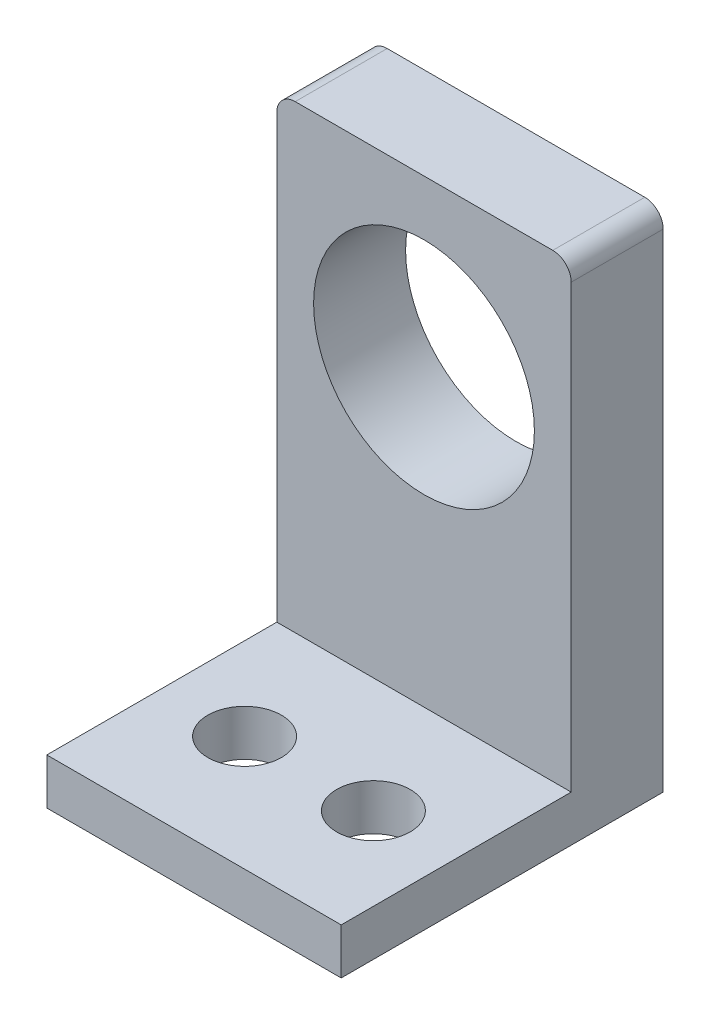
ISO-10303-21;
HEADER;
FILE_DESCRIPTION(('STEP AP214'),'2;1');
FILE_NAME('part.step','',(''),(''),'','','');
FILE_SCHEMA(('AUTOMOTIVE_DESIGN { 1 0 10303 214 1 1 1 1 }'));
ENDSEC;
DATA;
#1=APPLICATION_CONTEXT('core data for automotive mechanical design processes');
#2=APPLICATION_PROTOCOL_DEFINITION('international standard','automotive_design',2000,#1);
#3=PRODUCT_CONTEXT('',#1,'mechanical');
#4=PRODUCT('Part','Part','',(#3));
#5=PRODUCT_RELATED_PRODUCT_CATEGORY('part','',(#4));
#6=PRODUCT_DEFINITION_FORMATION('','',#4);
#7=PRODUCT_DEFINITION_CONTEXT('part definition',#1,'design');
#8=PRODUCT_DEFINITION('design','',#6,#7);
#9=PRODUCT_DEFINITION_SHAPE('','',#8);
#10=(LENGTH_UNIT() NAMED_UNIT(*) SI_UNIT(.MILLI.,.METRE.));
#11=(NAMED_UNIT(*) PLANE_ANGLE_UNIT() SI_UNIT($,.RADIAN.));
#12=(NAMED_UNIT(*) SI_UNIT($,.STERADIAN.) SOLID_ANGLE_UNIT());
#13=UNCERTAINTY_MEASURE_WITH_UNIT(LENGTH_MEASURE(1.E-05),#10,'distance_accuracy_value','');
#14=(GEOMETRIC_REPRESENTATION_CONTEXT(3) GLOBAL_UNCERTAINTY_ASSIGNED_CONTEXT((#13)) GLOBAL_UNIT_ASSIGNED_CONTEXT((#10,
#11,#12)) REPRESENTATION_CONTEXT('',''));
#15=CARTESIAN_POINT('',(0.,0.,0.));
#16=DIRECTION('',(0.,0.,1.));
#17=DIRECTION('',(1.,0.,0.));
#18=AXIS2_PLACEMENT_3D('',#15,#16,#17);
#19=CARTESIAN_POINT('',(-14.,25.5,10.));
#20=DIRECTION('',(0.,0.,-1.));
#21=DIRECTION('',(-1.,0.,0.));
#22=AXIS2_PLACEMENT_3D('',#19,#20,#21);
#23=PLANE('',#22);
#24=CARTESIAN_POINT('',(0.,9.49999999999999,10.));
#25=DIRECTION('',(0.,0.,1.));
#26=DIRECTION('',(1.,0.,0.));
#27=AXIS2_PLACEMENT_3D('',#24,#25,#26);
#28=CIRCLE('',#27,12.);
#29=CARTESIAN_POINT('',(12.,9.49999999999999,10.));
#30=VERTEX_POINT('',#29);
#31=EDGE_CURVE('E153',#30,#30,#28,.T.);
#32=ORIENTED_EDGE('',*,*,#31,.F.);
#33=EDGE_LOOP('',(#32));
#34=FACE_BOUND('',#33,.T.);
#35=DIRECTION('',(-1.,0.,0.));
#36=VECTOR('',#35,1.);
#37=CARTESIAN_POINT('',(-16.,-22.5,10.));
#38=LINE('',#37,#36);
#39=CARTESIAN_POINT('',(16.,-22.5,10.));
#40=VERTEX_POINT('',#39);
#41=CARTESIAN_POINT('',(-16.,-22.5,10.));
#42=VERTEX_POINT('',#41);
#43=EDGE_CURVE('E57',#40,#42,#38,.T.);
#44=ORIENTED_EDGE('',*,*,#43,.F.);
#45=DIRECTION('',(0.,1.,0.));
#46=VECTOR('',#45,1.);
#47=CARTESIAN_POINT('',(16.,-27.5,10.));
#48=LINE('',#47,#46);
#49=CARTESIAN_POINT('',(16.,25.5,10.));
#50=VERTEX_POINT('',#49);
#51=EDGE_CURVE('E95',#40,#50,#48,.T.);
#52=ORIENTED_EDGE('',*,*,#51,.T.);
#53=CARTESIAN_POINT('',(14.,25.5,10.));
#54=DIRECTION('',(0.,0.,1.));
#55=DIRECTION('',(-1.,0.,0.));
#56=AXIS2_PLACEMENT_3D('',#53,#54,#55);
#57=CIRCLE('',#56,2.);
#58=CARTESIAN_POINT('',(14.,27.5,10.));
#59=VERTEX_POINT('',#58);
#60=EDGE_CURVE('E165',#50,#59,#57,.T.);
#61=ORIENTED_EDGE('',*,*,#60,.T.);
#62=DIRECTION('',(-1.,0.,0.));
#63=VECTOR('',#62,1.);
#64=CARTESIAN_POINT('',(-14.,27.5,10.));
#65=LINE('',#64,#63);
#66=CARTESIAN_POINT('',(-14.,27.5,10.));
#67=VERTEX_POINT('',#66);
#68=EDGE_CURVE('E168',#59,#67,#65,.T.);
#69=ORIENTED_EDGE('',*,*,#68,.T.);
#70=CARTESIAN_POINT('',(-14.,25.5,10.));
#71=DIRECTION('',(0.,0.,1.));
#72=DIRECTION('',(-1.,0.,0.));
#73=AXIS2_PLACEMENT_3D('',#70,#71,#72);
#74=CIRCLE('',#73,2.);
#75=CARTESIAN_POINT('',(-16.,25.5,10.));
#76=VERTEX_POINT('',#75);
#77=EDGE_CURVE('E64',#67,#76,#74,.T.);
#78=ORIENTED_EDGE('',*,*,#77,.T.);
#79=DIRECTION('',(0.,-1.,0.));
#80=VECTOR('',#79,1.);
#81=CARTESIAN_POINT('',(-16.,-27.5,10.));
#82=LINE('',#81,#80);
#83=EDGE_CURVE('E160',#76,#42,#82,.T.);
#84=ORIENTED_EDGE('',*,*,#83,.T.);
#85=EDGE_LOOP('',(#44,#52,#61,#69,#78,#84));
#86=FACE_BOUND('',#85,.T.);
#87=ADVANCED_FACE('F41',(#34,#86),#23,.F.);
#88=CARTESIAN_POINT('',(-14.,25.5,0.));
#89=DIRECTION('',(0.,0.,-1.));
#90=DIRECTION('',(-1.,0.,0.));
#91=AXIS2_PLACEMENT_3D('',#88,#89,#90);
#92=PLANE('',#91);
#93=DIRECTION('',(0.,-1.,0.));
#94=VECTOR('',#93,1.);
#95=CARTESIAN_POINT('',(-16.,-27.5,0.));
#96=LINE('',#95,#94);
#97=CARTESIAN_POINT('',(-16.,25.5,0.));
#98=VERTEX_POINT('',#97);
#99=CARTESIAN_POINT('',(-16.,-27.5,0.));
#100=VERTEX_POINT('',#99);
#101=EDGE_CURVE('E118',#98,#100,#96,.T.);
#102=ORIENTED_EDGE('',*,*,#101,.F.);
#103=CARTESIAN_POINT('',(-14.,25.5,0.));
#104=DIRECTION('',(0.,0.,1.));
#105=DIRECTION('',(-1.,0.,0.));
#106=AXIS2_PLACEMENT_3D('',#103,#104,#105);
#107=CIRCLE('',#106,2.);
#108=CARTESIAN_POINT('',(-14.,27.5,0.));
#109=VERTEX_POINT('',#108);
#110=EDGE_CURVE('E91',#109,#98,#107,.T.);
#111=ORIENTED_EDGE('',*,*,#110,.F.);
#112=DIRECTION('',(-1.,0.,0.));
#113=VECTOR('',#112,1.);
#114=CARTESIAN_POINT('',(-14.,27.5,0.));
#115=LINE('',#114,#113);
#116=CARTESIAN_POINT('',(14.,27.5,0.));
#117=VERTEX_POINT('',#116);
#118=EDGE_CURVE('E185',#117,#109,#115,.T.);
#119=ORIENTED_EDGE('',*,*,#118,.F.);
#120=CARTESIAN_POINT('',(14.,25.5,0.));
#121=DIRECTION('',(0.,0.,1.));
#122=DIRECTION('',(-1.,0.,0.));
#123=AXIS2_PLACEMENT_3D('',#120,#121,#122);
#124=CIRCLE('',#123,2.);
#125=CARTESIAN_POINT('',(16.,25.5,0.));
#126=VERTEX_POINT('',#125);
#127=EDGE_CURVE('E182',#126,#117,#124,.T.);
#128=ORIENTED_EDGE('',*,*,#127,.F.);
#129=DIRECTION('',(0.,1.,0.));
#130=VECTOR('',#129,1.);
#131=CARTESIAN_POINT('',(16.,-27.5,0.));
#132=LINE('',#131,#130);
#133=CARTESIAN_POINT('',(16.,-27.5,0.));
#134=VERTEX_POINT('',#133);
#135=EDGE_CURVE('E179',#134,#126,#132,.T.);
#136=ORIENTED_EDGE('',*,*,#135,.F.);
#137=DIRECTION('',(1.,0.,0.));
#138=VECTOR('',#137,1.);
#139=CARTESIAN_POINT('',(-16.,-27.5,0.));
#140=LINE('',#139,#138);
#141=EDGE_CURVE('E176',#100,#134,#140,.T.);
#142=ORIENTED_EDGE('',*,*,#141,.F.);
#143=EDGE_LOOP('',(#102,#111,#119,#128,#136,#142));
#144=FACE_BOUND('',#143,.T.);
#145=CARTESIAN_POINT('',(0.,9.49999999999999,0.));
#146=DIRECTION('',(0.,0.,1.));
#147=DIRECTION('',(1.,0.,0.));
#148=AXIS2_PLACEMENT_3D('',#145,#146,#147);
#149=CIRCLE('',#148,12.);
#150=CARTESIAN_POINT('',(12.,9.49999999999999,0.));
#151=VERTEX_POINT('',#150);
#152=EDGE_CURVE('E152',#151,#151,#149,.T.);
#153=ORIENTED_EDGE('',*,*,#152,.T.);
#154=EDGE_LOOP('',(#153));
#155=FACE_BOUND('',#154,.T.);
#156=ADVANCED_FACE('F209',(#144,#155),#92,.T.);
#157=CARTESIAN_POINT('',(-16.,-27.5,10.));
#158=DIRECTION('',(1.,0.,0.));
#159=DIRECTION('',(0.,0.,-1.));
#160=AXIS2_PLACEMENT_3D('',#157,#158,#159);
#161=PLANE('',#160);
#162=ORIENTED_EDGE('',*,*,#101,.T.);
#163=DIRECTION('',(0.,0.,-1.));
#164=VECTOR('',#163,1.);
#165=CARTESIAN_POINT('',(-16.,-27.5,10.));
#166=LINE('',#165,#164);
#167=CARTESIAN_POINT('',(-16.,-27.5,35.));
#168=VERTEX_POINT('',#167);
#169=EDGE_CURVE('E11',#168,#100,#166,.T.);
#170=ORIENTED_EDGE('',*,*,#169,.F.);
#171=DIRECTION('',(0.,-1.,0.));
#172=VECTOR('',#171,1.);
#173=CARTESIAN_POINT('',(-16.,-27.5,35.));
#174=LINE('',#173,#172);
#175=CARTESIAN_POINT('',(-16.,-22.5,35.));
#176=VERTEX_POINT('',#175);
#177=EDGE_CURVE('E116',#176,#168,#174,.T.);
#178=ORIENTED_EDGE('',*,*,#177,.F.);
#179=DIRECTION('',(0.,0.,-1.));
#180=VECTOR('',#179,1.);
#181=CARTESIAN_POINT('',(-16.,-22.5,35.));
#182=LINE('',#181,#180);
#183=EDGE_CURVE('E144',#176,#42,#182,.T.);
#184=ORIENTED_EDGE('',*,*,#183,.T.);
#185=ORIENTED_EDGE('',*,*,#83,.F.);
#186=DIRECTION('',(0.,0.,-1.));
#187=VECTOR('',#186,1.);
#188=CARTESIAN_POINT('',(-16.,25.5,10.));
#189=LINE('',#188,#187);
#190=EDGE_CURVE('E173',#76,#98,#189,.T.);
#191=ORIENTED_EDGE('',*,*,#190,.T.);
#192=EDGE_LOOP('',(#162,#170,#178,#184,#185,#191));
#193=FACE_BOUND('',#192,.T.);
#194=ADVANCED_FACE('F43',(#193),#161,.F.);
#195=CARTESIAN_POINT('',(-16.,-27.5,10.));
#196=DIRECTION('',(0.,1.,0.));
#197=DIRECTION('',(0.,0.,1.));
#198=AXIS2_PLACEMENT_3D('',#195,#196,#197);
#199=PLANE('',#198);
#200=CARTESIAN_POINT('',(-7.00000000000001,-27.5,22.5));
#201=DIRECTION('',(0.,1.,0.));
#202=DIRECTION('',(0.,0.,1.));
#203=AXIS2_PLACEMENT_3D('',#200,#201,#202);
#204=CIRCLE('',#203,4.);
#205=CARTESIAN_POINT('',(-7.00000000000001,-27.5,26.5));
#206=VERTEX_POINT('',#205);
#207=EDGE_CURVE('E136',#206,#206,#204,.T.);
#208=ORIENTED_EDGE('',*,*,#207,.T.);
#209=EDGE_LOOP('',(#208));
#210=FACE_BOUND('',#209,.T.);
#211=CARTESIAN_POINT('',(6.99999999999999,-27.5,22.5));
#212=DIRECTION('',(0.,1.,0.));
#213=DIRECTION('',(0.,0.,1.));
#214=AXIS2_PLACEMENT_3D('',#211,#212,#213);
#215=CIRCLE('',#214,4.);
#216=CARTESIAN_POINT('',(6.99999999999999,-27.5,26.5));
#217=VERTEX_POINT('',#216);
#218=EDGE_CURVE('E250',#217,#217,#215,.T.);
#219=ORIENTED_EDGE('',*,*,#218,.T.);
#220=EDGE_LOOP('',(#219));
#221=FACE_BOUND('',#220,.T.);
#222=ORIENTED_EDGE('',*,*,#141,.T.);
#223=DIRECTION('',(0.,0.,-1.));
#224=VECTOR('',#223,1.);
#225=CARTESIAN_POINT('',(16.,-27.5,10.));
#226=LINE('',#225,#224);
#227=CARTESIAN_POINT('',(16.,-27.5,35.));
#228=VERTEX_POINT('',#227);
#229=EDGE_CURVE('E50',#228,#134,#226,.T.);
#230=ORIENTED_EDGE('',*,*,#229,.F.);
#231=DIRECTION('',(1.,0.,0.));
#232=VECTOR('',#231,1.);
#233=CARTESIAN_POINT('',(-16.,-27.5,35.));
#234=LINE('',#233,#232);
#235=EDGE_CURVE('E121',#168,#228,#234,.T.);
#236=ORIENTED_EDGE('',*,*,#235,.F.);
#237=ORIENTED_EDGE('',*,*,#169,.T.);
#238=EDGE_LOOP('',(#222,#230,#236,#237));
#239=FACE_BOUND('',#238,.T.);
#240=ADVANCED_FACE('F122',(#210,#221,#239),#199,.F.);
#241=CARTESIAN_POINT('',(16.,-27.5,10.));
#242=DIRECTION('',(-1.,0.,0.));
#243=DIRECTION('',(0.,0.,1.));
#244=AXIS2_PLACEMENT_3D('',#241,#242,#243);
#245=PLANE('',#244);
#246=ORIENTED_EDGE('',*,*,#135,.T.);
#247=DIRECTION('',(0.,0.,-1.));
#248=VECTOR('',#247,1.);
#249=CARTESIAN_POINT('',(16.,25.5,10.));
#250=LINE('',#249,#248);
#251=EDGE_CURVE('E199',#50,#126,#250,.T.);
#252=ORIENTED_EDGE('',*,*,#251,.F.);
#253=ORIENTED_EDGE('',*,*,#51,.F.);
#254=DIRECTION('',(0.,0.,-1.));
#255=VECTOR('',#254,1.);
#256=CARTESIAN_POINT('',(16.,-22.5,35.));
#257=LINE('',#256,#255);
#258=CARTESIAN_POINT('',(16.,-22.5,35.));
#259=VERTEX_POINT('',#258);
#260=EDGE_CURVE('E148',#259,#40,#257,.T.);
#261=ORIENTED_EDGE('',*,*,#260,.F.);
#262=DIRECTION('',(0.,1.,0.));
#263=VECTOR('',#262,1.);
#264=CARTESIAN_POINT('',(16.,-27.5,35.));
#265=LINE('',#264,#263);
#266=EDGE_CURVE('E127',#228,#259,#265,.T.);
#267=ORIENTED_EDGE('',*,*,#266,.F.);
#268=ORIENTED_EDGE('',*,*,#229,.T.);
#269=EDGE_LOOP('',(#246,#252,#253,#261,#267,#268));
#270=FACE_BOUND('',#269,.T.);
#271=ADVANCED_FACE('F205',(#270),#245,.F.);
#272=CARTESIAN_POINT('',(14.,25.5,10.));
#273=DIRECTION('',(0.,0.,-1.));
#274=DIRECTION('',(-1.,0.,0.));
#275=AXIS2_PLACEMENT_3D('',#272,#273,#274);
#276=CYLINDRICAL_SURFACE('',#275,2.);
#277=ORIENTED_EDGE('',*,*,#127,.T.);
#278=DIRECTION('',(0.,0.,-1.));
#279=VECTOR('',#278,1.);
#280=CARTESIAN_POINT('',(14.,27.5,10.));
#281=LINE('',#280,#279);
#282=EDGE_CURVE('E195',#59,#117,#281,.T.);
#283=ORIENTED_EDGE('',*,*,#282,.F.);
#284=ORIENTED_EDGE('',*,*,#60,.F.);
#285=ORIENTED_EDGE('',*,*,#251,.T.);
#286=EDGE_LOOP('',(#277,#283,#284,#285));
#287=FACE_BOUND('',#286,.T.);
#288=ADVANCED_FACE('F214',(#287),#276,.T.);
#289=CARTESIAN_POINT('',(-14.,27.5,10.));
#290=DIRECTION('',(0.,-1.,0.));
#291=DIRECTION('',(0.,0.,-1.));
#292=AXIS2_PLACEMENT_3D('',#289,#290,#291);
#293=PLANE('',#292);
#294=ORIENTED_EDGE('',*,*,#118,.T.);
#295=DIRECTION('',(0.,0.,-1.));
#296=VECTOR('',#295,1.);
#297=CARTESIAN_POINT('',(-14.,27.5,10.));
#298=LINE('',#297,#296);
#299=EDGE_CURVE('E192',#67,#109,#298,.T.);
#300=ORIENTED_EDGE('',*,*,#299,.F.);
#301=ORIENTED_EDGE('',*,*,#68,.F.);
#302=ORIENTED_EDGE('',*,*,#282,.T.);
#303=EDGE_LOOP('',(#294,#300,#301,#302));
#304=FACE_BOUND('',#303,.T.);
#305=ADVANCED_FACE('F218',(#304),#293,.F.);
#306=CARTESIAN_POINT('',(-14.,25.5,10.));
#307=DIRECTION('',(0.,0.,-1.));
#308=DIRECTION('',(-1.,0.,0.));
#309=AXIS2_PLACEMENT_3D('',#306,#307,#308);
#310=CYLINDRICAL_SURFACE('',#309,2.);
#311=ORIENTED_EDGE('',*,*,#110,.T.);
#312=ORIENTED_EDGE('',*,*,#190,.F.);
#313=ORIENTED_EDGE('',*,*,#77,.F.);
#314=ORIENTED_EDGE('',*,*,#299,.T.);
#315=EDGE_LOOP('',(#311,#312,#313,#314));
#316=FACE_BOUND('',#315,.T.);
#317=ADVANCED_FACE('F232',(#316),#310,.T.);
#318=CARTESIAN_POINT('',(0.,9.49999999999999,10.));
#319=DIRECTION('',(0.,0.,-1.));
#320=DIRECTION('',(-1.,0.,0.));
#321=AXIS2_PLACEMENT_3D('',#318,#319,#320);
#322=CYLINDRICAL_SURFACE('',#321,12.);
#323=ORIENTED_EDGE('',*,*,#31,.T.);
#324=EDGE_LOOP('',(#323));
#325=FACE_BOUND('',#324,.T.);
#326=ORIENTED_EDGE('',*,*,#152,.F.);
#327=EDGE_LOOP('',(#326));
#328=FACE_BOUND('',#327,.T.);
#329=ADVANCED_FACE('F229',(#325,#328),#322,.F.);
#330=CARTESIAN_POINT('',(-16.,-22.5,35.));
#331=DIRECTION('',(0.,-1.,0.));
#332=DIRECTION('',(0.,0.,-1.));
#333=AXIS2_PLACEMENT_3D('',#330,#331,#332);
#334=PLANE('',#333);
#335=CARTESIAN_POINT('',(-7.00000000000001,-22.5,22.5));
#336=DIRECTION('',(0.,1.,0.));
#337=DIRECTION('',(0.,0.,1.));
#338=AXIS2_PLACEMENT_3D('',#335,#336,#337);
#339=CIRCLE('',#338,4.);
#340=CARTESIAN_POINT('',(-7.00000000000001,-22.5,26.5));
#341=VERTEX_POINT('',#340);
#342=EDGE_CURVE('E253',#341,#341,#339,.T.);
#343=ORIENTED_EDGE('',*,*,#342,.F.);
#344=EDGE_LOOP('',(#343));
#345=FACE_BOUND('',#344,.T.);
#346=CARTESIAN_POINT('',(6.99999999999999,-22.5,22.5));
#347=DIRECTION('',(0.,1.,0.));
#348=DIRECTION('',(0.,0.,1.));
#349=AXIS2_PLACEMENT_3D('',#346,#347,#348);
#350=CIRCLE('',#349,4.);
#351=CARTESIAN_POINT('',(6.99999999999999,-22.5,26.5));
#352=VERTEX_POINT('',#351);
#353=EDGE_CURVE('E257',#352,#352,#350,.T.);
#354=ORIENTED_EDGE('',*,*,#353,.F.);
#355=EDGE_LOOP('',(#354));
#356=FACE_BOUND('',#355,.T.);
#357=ORIENTED_EDGE('',*,*,#43,.T.);
#358=ORIENTED_EDGE('',*,*,#183,.F.);
#359=DIRECTION('',(-1.,0.,0.));
#360=VECTOR('',#359,1.);
#361=CARTESIAN_POINT('',(-16.,-22.5,35.));
#362=LINE('',#361,#360);
#363=EDGE_CURVE('E131',#259,#176,#362,.T.);
#364=ORIENTED_EDGE('',*,*,#363,.F.);
#365=ORIENTED_EDGE('',*,*,#260,.T.);
#366=EDGE_LOOP('',(#357,#358,#364,#365));
#367=FACE_BOUND('',#366,.T.);
#368=ADVANCED_FACE('F266',(#345,#356,#367),#334,.F.);
#369=CARTESIAN_POINT('',(0.,0.,35.));
#370=DIRECTION('',(0.,0.,-1.));
#371=DIRECTION('',(-1.,0.,0.));
#372=AXIS2_PLACEMENT_3D('',#369,#370,#371);
#373=PLANE('',#372);
#374=ORIENTED_EDGE('',*,*,#177,.T.);
#375=ORIENTED_EDGE('',*,*,#235,.T.);
#376=ORIENTED_EDGE('',*,*,#266,.T.);
#377=ORIENTED_EDGE('',*,*,#363,.T.);
#378=EDGE_LOOP('',(#374,#375,#376,#377));
#379=FACE_BOUND('',#378,.T.);
#380=ADVANCED_FACE('F129',(#379),#373,.F.);
#381=CARTESIAN_POINT('',(6.99999999999999,-47.5,22.5));
#382=DIRECTION('',(0.,1.,0.));
#383=DIRECTION('',(0.,0.,1.));
#384=AXIS2_PLACEMENT_3D('',#381,#382,#383);
#385=CYLINDRICAL_SURFACE('',#384,4.);
#386=ORIENTED_EDGE('',*,*,#353,.T.);
#387=EDGE_LOOP('',(#386));
#388=FACE_BOUND('',#387,.T.);
#389=ORIENTED_EDGE('',*,*,#218,.F.);
#390=EDGE_LOOP('',(#389));
#391=FACE_BOUND('',#390,.T.);
#392=ADVANCED_FACE('F264',(#388,#391),#385,.F.);
#393=CARTESIAN_POINT('',(-7.00000000000001,-47.5,22.5));
#394=DIRECTION('',(0.,1.,0.));
#395=DIRECTION('',(0.,0.,1.));
#396=AXIS2_PLACEMENT_3D('',#393,#394,#395);
#397=CYLINDRICAL_SURFACE('',#396,4.);
#398=ORIENTED_EDGE('',*,*,#342,.T.);
#399=EDGE_LOOP('',(#398));
#400=FACE_BOUND('',#399,.T.);
#401=ORIENTED_EDGE('',*,*,#207,.F.);
#402=EDGE_LOOP('',(#401));
#403=FACE_BOUND('',#402,.T.);
#404=ADVANCED_FACE('F281',(#400,#403),#397,.F.);
#405=CLOSED_SHELL('',(#87,#156,#194,#240,#271,#288,#305,#317,#329,#368,#380,#392,#404));
#406=MANIFOLD_SOLID_BREP('B2',#405);
#407=ADVANCED_BREP_SHAPE_REPRESENTATION('',(#18,#406),#14);
#408=SHAPE_DEFINITION_REPRESENTATION(#9,#407);
ENDSEC;
END-ISO-10303-21;
